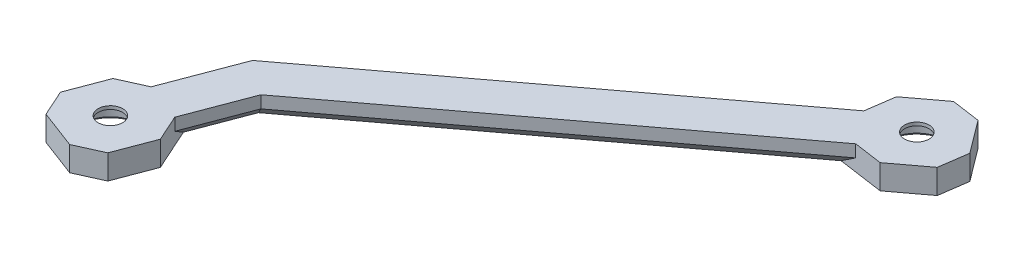
ISO-10303-21;
HEADER;
FILE_DESCRIPTION(('STEP AP214'),'2;1');
FILE_NAME('part.step','',(''),(''),'','','');
FILE_SCHEMA(('AUTOMOTIVE_DESIGN { 1 0 10303 214 1 1 1 1 }'));
ENDSEC;
DATA;
#1=APPLICATION_CONTEXT('core data for automotive mechanical design processes');
#2=APPLICATION_PROTOCOL_DEFINITION('international standard','automotive_design',2000,#1);
#3=PRODUCT_CONTEXT('',#1,'mechanical');
#4=PRODUCT('Part','Part','',(#3));
#5=PRODUCT_RELATED_PRODUCT_CATEGORY('part','',(#4));
#6=PRODUCT_DEFINITION_FORMATION('','',#4);
#7=PRODUCT_DEFINITION_CONTEXT('part definition',#1,'design');
#8=PRODUCT_DEFINITION('design','',#6,#7);
#9=PRODUCT_DEFINITION_SHAPE('','',#8);
#10=(LENGTH_UNIT() NAMED_UNIT(*) SI_UNIT(.MILLI.,.METRE.));
#11=(NAMED_UNIT(*) PLANE_ANGLE_UNIT() SI_UNIT($,.RADIAN.));
#12=(NAMED_UNIT(*) SI_UNIT($,.STERADIAN.) SOLID_ANGLE_UNIT());
#13=UNCERTAINTY_MEASURE_WITH_UNIT(LENGTH_MEASURE(1.E-05),#10,'distance_accuracy_value','');
#14=(GEOMETRIC_REPRESENTATION_CONTEXT(3) GLOBAL_UNCERTAINTY_ASSIGNED_CONTEXT((#13)) GLOBAL_UNIT_ASSIGNED_CONTEXT((#10,
#11,#12)) REPRESENTATION_CONTEXT('',''));
#15=CARTESIAN_POINT('',(0.,0.,0.));
#16=DIRECTION('',(0.,0.,1.));
#17=DIRECTION('',(1.,0.,0.));
#18=AXIS2_PLACEMENT_3D('',#15,#16,#17);
#19=CARTESIAN_POINT('',(129.479734703124,-542.305140304565,54.017746752288));
#20=DIRECTION('',(0.,-1.,0.));
#21=DIRECTION('',(0.,0.,-1.));
#22=AXIS2_PLACEMENT_3D('',#19,#20,#21);
#23=CYLINDRICAL_SURFACE('',#22,6.75);
#24=CARTESIAN_POINT('',(129.479734703124,-542.305140304565,54.017746752288));
#25=DIRECTION('',(0.,-1.,0.));
#26=DIRECTION('',(0.,0.,-1.));
#27=AXIS2_PLACEMENT_3D('',#24,#25,#26);
#28=CIRCLE('',#27,6.75);
#29=CARTESIAN_POINT('',(129.479734703124,-542.305140304565,47.267746752288));
#30=VERTEX_POINT('',#29);
#31=EDGE_CURVE('E228',#30,#30,#28,.T.);
#32=ORIENTED_EDGE('',*,*,#31,.F.);
#33=EDGE_LOOP('',(#32));
#34=FACE_BOUND('',#33,.T.);
#35=CARTESIAN_POINT('',(129.479734703124,-546.505140304565,54.017746752288));
#36=DIRECTION('',(0.,-1.,0.));
#37=DIRECTION('',(0.,0.,-1.));
#38=AXIS2_PLACEMENT_3D('',#35,#36,#37);
#39=CIRCLE('',#38,6.75);
#40=CARTESIAN_POINT('',(129.479734703124,-546.505140304565,47.267746752288));
#41=VERTEX_POINT('',#40);
#42=EDGE_CURVE('E404',#41,#41,#39,.F.);
#43=ORIENTED_EDGE('',*,*,#42,.F.);
#44=EDGE_LOOP('',(#43));
#45=FACE_BOUND('',#44,.T.);
#46=ADVANCED_FACE('F38',(#34,#45),#23,.F.);
#47=CARTESIAN_POINT('',(27.0683923401905,-542.305140304565,149.47530428751));
#48=DIRECTION('',(0.,-1.,0.));
#49=DIRECTION('',(0.,0.,-1.));
#50=AXIS2_PLACEMENT_3D('',#47,#48,#49);
#51=CYLINDRICAL_SURFACE('',#50,6.75);
#52=CARTESIAN_POINT('',(27.0683923401905,-542.305140304565,149.47530428751));
#53=DIRECTION('',(0.,-1.,0.));
#54=DIRECTION('',(0.,0.,-1.));
#55=AXIS2_PLACEMENT_3D('',#52,#53,#54);
#56=CIRCLE('',#55,6.75);
#57=CARTESIAN_POINT('',(27.0683923401905,-542.305140304565,142.72530428751));
#58=VERTEX_POINT('',#57);
#59=EDGE_CURVE('E223',#58,#58,#56,.T.);
#60=ORIENTED_EDGE('',*,*,#59,.F.);
#61=EDGE_LOOP('',(#60));
#62=FACE_BOUND('',#61,.T.);
#63=CARTESIAN_POINT('',(27.0683923401905,-546.505140304565,149.47530428751));
#64=DIRECTION('',(0.,-1.,0.));
#65=DIRECTION('',(0.,0.,-1.));
#66=AXIS2_PLACEMENT_3D('',#63,#64,#65);
#67=CIRCLE('',#66,6.75);
#68=CARTESIAN_POINT('',(27.0683923401905,-546.505140304565,142.72530428751));
#69=VERTEX_POINT('',#68);
#70=EDGE_CURVE('E401',#69,#69,#67,.F.);
#71=ORIENTED_EDGE('',*,*,#70,.F.);
#72=EDGE_LOOP('',(#71));
#73=FACE_BOUND('',#72,.T.);
#74=ADVANCED_FACE('F440',(#62,#73),#51,.F.);
#75=CARTESIAN_POINT('',(-49.6434018320776,0.,131.125269074854));
#76=DIRECTION('',(-0.354069498432484,0.,0.935219113512854));
#77=DIRECTION('',(0.935219113512854,0.,0.354069498432484));
#78=AXIS2_PLACEMENT_3D('',#75,#76,#77);
#79=PLANE('',#78);
#80=DIRECTION('',(0.,-1.,0.));
#81=VECTOR('',#80,1.);
#82=CARTESIAN_POINT('',(28.2037928700447,-541.505098342896,160.59784591198));
#83=LINE('',#82,#81);
#84=CARTESIAN_POINT('',(28.2037928700447,-541.505098342895,160.59784591198));
#85=VERTEX_POINT('',#84);
#86=CARTESIAN_POINT('',(28.2037928700447,-547.505140304565,160.59784591198));
#87=VERTEX_POINT('',#86);
#88=EDGE_CURVE('E96',#85,#87,#83,.T.);
#89=ORIENTED_EDGE('',*,*,#88,.F.);
#90=DIRECTION('',(0.935219113512854,0.,0.354069498432484));
#91=VECTOR('',#90,1.);
#92=CARTESIAN_POINT('',(28.2037928700447,-541.505098342895,160.59784591198));
#93=LINE('',#92,#91);
#94=CARTESIAN_POINT('',(18.8516024500132,-541.505098342895,157.057151198387));
#95=VERTEX_POINT('',#94);
#96=EDGE_CURVE('E256',#95,#85,#93,.T.);
#97=ORIENTED_EDGE('',*,*,#96,.F.);
#98=DIRECTION('',(0.,1.,0.));
#99=VECTOR('',#98,1.);
#100=CARTESIAN_POINT('',(18.8516024500132,-547.505140304565,157.057151198387));
#101=LINE('',#100,#99);
#102=CARTESIAN_POINT('',(18.8516024500132,-547.505140304565,157.057151198387));
#103=VERTEX_POINT('',#102);
#104=EDGE_CURVE('E392',#103,#95,#101,.T.);
#105=ORIENTED_EDGE('',*,*,#104,.F.);
#106=DIRECTION('',(0.935219113512854,0.,0.354069498432484));
#107=VECTOR('',#106,1.);
#108=CARTESIAN_POINT('',(18.8516024500132,-547.505140304565,157.057151198387));
#109=LINE('',#108,#107);
#110=EDGE_CURVE('E101',#103,#87,#109,.T.);
#111=ORIENTED_EDGE('',*,*,#110,.T.);
#112=EDGE_LOOP('',(#89,#97,#105,#111));
#113=FACE_BOUND('',#112,.T.);
#114=ADVANCED_FACE('F40',(#113),#79,.T.);
#115=CARTESIAN_POINT('',(-43.1708205184204,0.,19.4593086700157));
#116=DIRECTION('',(-0.911664969927574,0.,0.410934280155544));
#117=DIRECTION('',(0.410934280155544,0.,0.911664969927574));
#118=AXIS2_PLACEMENT_3D('',#115,#116,#117);
#119=PLANE('',#118);
#120=ORIENTED_EDGE('',*,*,#104,.T.);
#121=DIRECTION('',(0.410934280155544,0.,0.911664969927574));
#122=VECTOR('',#121,1.);
#123=CARTESIAN_POINT('',(18.8516024500132,-541.505098342895,157.057151198387));
#124=LINE('',#123,#122);
#125=CARTESIAN_POINT('',(15.9458555281162,-541.505098342895,150.610700249672));
#126=VERTEX_POINT('',#125);
#127=EDGE_CURVE('E253',#126,#95,#124,.T.);
#128=ORIENTED_EDGE('',*,*,#127,.F.);
#129=DIRECTION('',(0.,1.,0.));
#130=VECTOR('',#129,1.);
#131=CARTESIAN_POINT('',(15.9458555281162,-547.505140304565,150.610700249672));
#132=LINE('',#131,#130);
#133=CARTESIAN_POINT('',(15.9458555281162,-547.505140304565,150.610700249672));
#134=VERTEX_POINT('',#133);
#135=EDGE_CURVE('E216',#134,#126,#132,.T.);
#136=ORIENTED_EDGE('',*,*,#135,.F.);
#137=DIRECTION('',(0.410934280155544,0.,0.911664969927574));
#138=VECTOR('',#137,1.);
#139=CARTESIAN_POINT('',(15.9458555281162,-547.505140304565,150.610700249672));
#140=LINE('',#139,#138);
#141=EDGE_CURVE('E214',#134,#103,#140,.T.);
#142=ORIENTED_EDGE('',*,*,#141,.T.);
#143=EDGE_LOOP('',(#120,#128,#136,#142));
#144=FACE_BOUND('',#143,.T.);
#145=ADVANCED_FACE('F542',(#144),#119,.T.);
#146=CARTESIAN_POINT('',(64.9283734286021,0.,144.044116871902));
#147=DIRECTION('',(0.410935769571844,0.,0.911664298569598));
#148=DIRECTION('',(0.911664298569598,0.,-0.410935769571844));
#149=AXIS2_PLACEMENT_3D('',#146,#147,#148);
#150=PLANE('',#149);
#151=DIRECTION('',(0.,-1.,0.));
#152=VECTOR('',#151,1.);
#153=CARTESIAN_POINT('',(34.6502363681793,-541.505098342896,157.692089676857));
#154=LINE('',#153,#152);
#155=CARTESIAN_POINT('',(34.6502363681793,-541.505098342895,157.692089676857));
#156=VERTEX_POINT('',#155);
#157=CARTESIAN_POINT('',(34.6502363681793,-547.505140304565,157.692089676857));
#158=VERTEX_POINT('',#157);
#159=EDGE_CURVE('E373',#156,#158,#154,.T.);
#160=ORIENTED_EDGE('',*,*,#159,.F.);
#161=DIRECTION('',(0.911664298569598,0.,-0.410935769571844));
#162=VECTOR('',#161,1.);
#163=CARTESIAN_POINT('',(34.6502363681793,-541.505098342895,157.692089676857));
#164=LINE('',#163,#162);
#165=EDGE_CURVE('E259',#85,#156,#164,.T.);
#166=ORIENTED_EDGE('',*,*,#165,.F.);
#167=ORIENTED_EDGE('',*,*,#88,.T.);
#168=DIRECTION('',(0.911664298569598,0.,-0.410935769571843));
#169=VECTOR('',#168,1.);
#170=CARTESIAN_POINT('',(28.2037928700447,-547.505140304565,160.59784591198));
#171=LINE('',#170,#169);
#172=EDGE_CURVE('E389',#87,#158,#171,.T.);
#173=ORIENTED_EDGE('',*,*,#172,.T.);
#174=EDGE_LOOP('',(#160,#166,#167,#173));
#175=FACE_BOUND('',#174,.T.);
#176=ADVANCED_FACE('F539',(#175),#150,.T.);
#177=CARTESIAN_POINT('',(144.952876856489,0.,20.710121558638));
#178=DIRECTION('',(0.989947038457378,0.,0.141438541598343));
#179=DIRECTION('',(0.141438541598343,0.,-0.989947038457378));
#180=AXIS2_PLACEMENT_3D('',#177,#178,#179);
#181=PLANE('',#180);
#182=DIRECTION('',(0.,-1.,0.));
#183=VECTOR('',#182,1.);
#184=CARTESIAN_POINT('',(140.479773283005,-541.505098342896,52.0179644227028));
#185=LINE('',#184,#183);
#186=CARTESIAN_POINT('',(140.479773283005,-541.505098342895,52.0179644227028));
#187=VERTEX_POINT('',#186);
#188=CARTESIAN_POINT('',(140.479773283005,-547.505140304565,52.0179644227028));
#189=VERTEX_POINT('',#188);
#190=EDGE_CURVE('E363',#187,#189,#185,.T.);
#191=ORIENTED_EDGE('',*,*,#190,.F.);
#192=DIRECTION('',(0.141438541598343,0.,-0.989947038457378));
#193=VECTOR('',#192,1.);
#194=CARTESIAN_POINT('',(140.479773283005,-541.505098342895,52.0179644227028));
#195=LINE('',#194,#193);
#196=CARTESIAN_POINT('',(139.479652047157,-541.505098342895,59.0179450809956));
#197=VERTEX_POINT('',#196);
#198=EDGE_CURVE('E234',#197,#187,#195,.T.);
#199=ORIENTED_EDGE('',*,*,#198,.F.);
#200=DIRECTION('',(0.,1.,0.));
#201=VECTOR('',#200,1.);
#202=CARTESIAN_POINT('',(139.479652047157,-547.505140304565,59.0179450809956));
#203=LINE('',#202,#201);
#204=CARTESIAN_POINT('',(139.479652047157,-547.505140304565,59.0179450809956));
#205=VERTEX_POINT('',#204);
#206=EDGE_CURVE('E207',#205,#197,#203,.T.);
#207=ORIENTED_EDGE('',*,*,#206,.F.);
#208=DIRECTION('',(0.141438541598343,0.,-0.989947038457378));
#209=VECTOR('',#208,1.);
#210=CARTESIAN_POINT('',(139.479652047157,-547.505140304565,59.0179450809956));
#211=LINE('',#210,#209);
#212=EDGE_CURVE('E217',#205,#189,#211,.T.);
#213=ORIENTED_EDGE('',*,*,#212,.T.);
#214=EDGE_LOOP('',(#191,#199,#207,#213));
#215=FACE_BOUND('',#214,.T.);
#216=ADVANCED_FACE('F536',(#215),#181,.T.);
#217=CARTESIAN_POINT('',(63.8189360018059,0.,24.1615655712421));
#218=DIRECTION('',(-0.935219013507438,0.,-0.354069762581013));
#219=DIRECTION('',(-0.354069762581013,0.,0.935219013507438));
#220=AXIS2_PLACEMENT_3D('',#217,#218,#219);
#221=PLANE('',#220);
#222=ORIENTED_EDGE('',*,*,#135,.T.);
#223=DIRECTION('',(-0.354069762581013,0.,0.935219013507438));
#224=VECTOR('',#223,1.);
#225=CARTESIAN_POINT('',(15.9458555281162,-541.505098342895,150.610700249672));
#226=LINE('',#225,#224);
#227=CARTESIAN_POINT('',(19.4865539669991,-541.505098342895,141.258507966995));
#228=VERTEX_POINT('',#227);
#229=EDGE_CURVE('E200',#228,#126,#226,.T.);
#230=ORIENTED_EDGE('',*,*,#229,.F.);
#231=DIRECTION('',(0.,1.,0.));
#232=VECTOR('',#231,1.);
#233=CARTESIAN_POINT('',(19.4865539669991,-547.505140304565,141.258507966995));
#234=LINE('',#233,#232);
#235=CARTESIAN_POINT('',(19.4865539669991,-547.505140304565,141.258507966995));
#236=VERTEX_POINT('',#235);
#237=EDGE_CURVE('E195',#236,#228,#234,.T.);
#238=ORIENTED_EDGE('',*,*,#237,.F.);
#239=DIRECTION('',(-0.354069762581013,0.,0.935219013507438));
#240=VECTOR('',#239,1.);
#241=CARTESIAN_POINT('',(19.4865539669991,-547.505140304565,141.258507966995));
#242=LINE('',#241,#240);
#243=EDGE_CURVE('E198',#236,#134,#242,.T.);
#244=ORIENTED_EDGE('',*,*,#243,.T.);
#245=EDGE_LOOP('',(#222,#230,#238,#244));
#246=FACE_BOUND('',#245,.T.);
#247=ADVANCED_FACE('F197',(#246),#221,.T.);
#248=CARTESIAN_POINT('',(82.52331484176,0.,31.242960281397));
#249=DIRECTION('',(0.935219013507438,0.,0.354069762581013));
#250=DIRECTION('',(0.354069762581013,0.,-0.935219013507438));
#251=AXIS2_PLACEMENT_3D('',#248,#249,#250);
#252=PLANE('',#251);
#253=DIRECTION('',(0.,1.,0.));
#254=VECTOR('',#253,1.);
#255=CARTESIAN_POINT('',(38.1909348070621,-547.505140304565,148.33989739418));
#256=LINE('',#255,#254);
#257=CARTESIAN_POINT('',(38.1909348070621,-547.505140304565,148.33989739418));
#258=VERTEX_POINT('',#257);
#259=CARTESIAN_POINT('',(38.1909348070621,-541.505098342895,148.33989739418));
#260=VERTEX_POINT('',#259);
#261=EDGE_CURVE('E368',#258,#260,#256,.T.);
#262=ORIENTED_EDGE('',*,*,#261,.T.);
#263=DIRECTION('',(0.354069762581013,0.,-0.935219013507438));
#264=VECTOR('',#263,1.);
#265=CARTESIAN_POINT('',(38.1909348070621,-541.505098342895,148.33989739418));
#266=LINE('',#265,#264);
#267=EDGE_CURVE('E262',#156,#260,#266,.T.);
#268=ORIENTED_EDGE('',*,*,#267,.F.);
#269=ORIENTED_EDGE('',*,*,#159,.T.);
#270=DIRECTION('',(0.354069762581013,0.,-0.935219013507438));
#271=VECTOR('',#270,1.);
#272=CARTESIAN_POINT('',(34.6502363681793,-547.505140304565,157.692089676857));
#273=LINE('',#272,#271);
#274=EDGE_CURVE('E374',#158,#258,#273,.T.);
#275=ORIENTED_EDGE('',*,*,#274,.T.);
#276=EDGE_LOOP('',(#262,#268,#269,#275));
#277=FACE_BOUND('',#276,.T.);
#278=ADVANCED_FACE('F529',(#277),#252,.T.);
#279=CARTESIAN_POINT('',(64.9414713142655,0.,-48.7040395860676));
#280=DIRECTION('',(0.800012203893529,0.,-0.599983727797195));
#281=DIRECTION('',(-0.599983727797195,0.,-0.800012203893529));
#282=AXIS2_PLACEMENT_3D('',#279,#280,#281);
#283=PLANE('',#282);
#284=DIRECTION('',(0.,-1.,0.));
#285=VECTOR('',#284,1.);
#286=CARTESIAN_POINT('',(134.479939937592,-541.505098342896,44.0178476274014));
#287=LINE('',#286,#285);
#288=CARTESIAN_POINT('',(134.479939937592,-541.505098342895,44.0178476274014));
#289=VERTEX_POINT('',#288);
#290=CARTESIAN_POINT('',(134.479939937592,-547.505140304565,44.0178476274014));
#291=VERTEX_POINT('',#290);
#292=EDGE_CURVE('E313',#289,#291,#287,.T.);
#293=ORIENTED_EDGE('',*,*,#292,.F.);
#294=DIRECTION('',(-0.599983727797195,0.,-0.800012203893529));
#295=VECTOR('',#294,1.);
#296=CARTESIAN_POINT('',(134.479939937592,-541.505098342895,44.0178476274014));
#297=LINE('',#296,#295);
#298=EDGE_CURVE('E237',#187,#289,#297,.T.);
#299=ORIENTED_EDGE('',*,*,#298,.F.);
#300=ORIENTED_EDGE('',*,*,#190,.T.);
#301=DIRECTION('',(-0.599983727797195,0.,-0.800012203893529));
#302=VECTOR('',#301,1.);
#303=CARTESIAN_POINT('',(140.479773283005,-547.505140304565,52.0179644227028));
#304=LINE('',#303,#302);
#305=EDGE_CURVE('E364',#189,#291,#304,.T.);
#306=ORIENTED_EDGE('',*,*,#305,.T.);
#307=EDGE_LOOP('',(#293,#299,#300,#306));
#308=FACE_BOUND('',#307,.T.);
#309=ADVANCED_FACE('F525',(#308),#283,.T.);
#310=CARTESIAN_POINT('',(78.5381950830812,0.,104.722079749864));
#311=DIRECTION('',(0.599983549015946,0.,0.800012337973753));
#312=DIRECTION('',(0.800012337973753,0.,-0.599983549015946));
#313=AXIS2_PLACEMENT_3D('',#310,#311,#312);
#314=PLANE('',#313);
#315=ORIENTED_EDGE('',*,*,#206,.T.);
#316=DIRECTION('',(0.800012337973753,0.,-0.599983549015946));
#317=VECTOR('',#316,1.);
#318=CARTESIAN_POINT('',(139.479652047157,-541.505098342895,59.0179450809956));
#319=LINE('',#318,#317);
#320=CARTESIAN_POINT('',(131.479516625404,-541.505098342895,65.0177896022797));
#321=VERTEX_POINT('',#320);
#322=EDGE_CURVE('E225',#321,#197,#319,.T.);
#323=ORIENTED_EDGE('',*,*,#322,.F.);
#324=DIRECTION('',(0.,-1.,0.));
#325=VECTOR('',#324,1.);
#326=CARTESIAN_POINT('',(131.479516625404,-541.505098342896,65.0177896022797));
#327=LINE('',#326,#325);
#328=CARTESIAN_POINT('',(131.479516625404,-547.505140304565,65.0177896022797));
#329=VERTEX_POINT('',#328);
#330=EDGE_CURVE('E352',#321,#329,#327,.T.);
#331=ORIENTED_EDGE('',*,*,#330,.T.);
#332=DIRECTION('',(0.800012337973753,0.,-0.599983549015946));
#333=VECTOR('',#332,1.);
#334=CARTESIAN_POINT('',(131.479516625404,-547.505140304565,65.0177896022797));
#335=LINE('',#334,#333);
#336=EDGE_CURVE('E353',#329,#205,#335,.T.);
#337=ORIENTED_EDGE('',*,*,#336,.T.);
#338=EDGE_LOOP('',(#315,#323,#331,#337));
#339=FACE_BOUND('',#338,.T.);
#340=ADVANCED_FACE('F521',(#339),#314,.T.);
#341=CARTESIAN_POINT('',(-6.47342282222166,0.,45.3073530902757));
#342=DIRECTION('',(0.141441565607845,0.,-0.98994660639774));
#343=DIRECTION('',(-0.98994660639774,0.,-0.141441565607845));
#344=AXIS2_PLACEMENT_3D('',#341,#342,#343);
#345=PLANE('',#344);
#346=ORIENTED_EDGE('',*,*,#330,.F.);
#347=DIRECTION('',(0.98994660639774,0.,0.141441565607845));
#348=VECTOR('',#347,1.);
#349=CARTESIAN_POINT('',(131.479516625404,-541.505098342895,65.0177896022797));
#350=LINE('',#349,#348);
#351=CARTESIAN_POINT('',(124.479532241821,-541.505098342895,64.0176460146904));
#352=VERTEX_POINT('',#351);
#353=EDGE_CURVE('E271',#352,#321,#350,.T.);
#354=ORIENTED_EDGE('',*,*,#353,.F.);
#355=DIRECTION('',(0.,-1.,0.));
#356=VECTOR('',#355,1.);
#357=CARTESIAN_POINT('',(124.479532241821,-541.505098342895,64.0176460146904));
#358=LINE('',#357,#356);
#359=CARTESIAN_POINT('',(124.479533558646,-544.505121518486,64.0176477705298));
#360=VERTEX_POINT('',#359);
#361=EDGE_CURVE('E274',#352,#360,#358,.T.);
#362=ORIENTED_EDGE('',*,*,#361,.T.);
#363=DIRECTION('',(0.808286247231902,0.577352850059177,0.115486055713726));
#364=VECTOR('',#363,1.);
#365=CARTESIAN_POINT('',(120.279543101788,-547.505140304565,63.417561352253));
#366=LINE('',#365,#364);
#367=CARTESIAN_POINT('',(120.279543101788,-547.505140304565,63.417561352253));
#368=VERTEX_POINT('',#367);
#369=EDGE_CURVE('E309',#368,#360,#366,.T.);
#370=ORIENTED_EDGE('',*,*,#369,.F.);
#371=DIRECTION('',(0.989946622204622,0.,0.14144145497576));
#372=VECTOR('',#371,1.);
#373=CARTESIAN_POINT('',(120.279543101788,-547.505140304565,63.417561352253));
#374=LINE('',#373,#372);
#375=EDGE_CURVE('E357',#368,#329,#374,.T.);
#376=ORIENTED_EDGE('',*,*,#375,.T.);
#377=EDGE_LOOP('',(#346,#354,#362,#370,#376));
#378=FACE_BOUND('',#377,.T.);
#379=ADVANCED_FACE('F514',(#378),#345,.F.);
#380=CARTESIAN_POINT('',(-23.8316201354801,0.,10.7421683441062));
#381=DIRECTION('',(0.9116645153807,0.,-0.410935288574337));
#382=DIRECTION('',(-0.410935288574337,0.,-0.9116645153807));
#383=AXIS2_PLACEMENT_3D('',#380,#381,#382);
#384=PLANE('',#383);
#385=DIRECTION('',(-0.335526570667552,-0.577354362423804,-0.74436809480678));
#386=VECTOR('',#385,1.);
#387=CARTESIAN_POINT('',(35.2851860225201,-544.50511932373,141.893461346626));
#388=LINE('',#387,#386);
#389=CARTESIAN_POINT('',(35.2851912753888,-544.505124940422,141.893463335336));
#390=VERTEX_POINT('',#389);
#391=CARTESIAN_POINT('',(33.5417389869689,-547.505140304566,138.025611639023));
#392=VERTEX_POINT('',#391);
#393=EDGE_CURVE('E335',#390,#392,#388,.T.);
#394=ORIENTED_EDGE('',*,*,#393,.F.);
#395=DIRECTION('',(0.,-1.,0.));
#396=VECTOR('',#395,1.);
#397=CARTESIAN_POINT('',(35.2851860225201,-541.505098342895,141.893461346626));
#398=LINE('',#397,#396);
#399=CARTESIAN_POINT('',(35.2851860225201,-541.505098342895,141.893461346626));
#400=VERTEX_POINT('',#399);
#401=EDGE_CURVE('E279',#400,#390,#398,.T.);
#402=ORIENTED_EDGE('',*,*,#401,.F.);
#403=DIRECTION('',(-0.410935288574337,0.,-0.9116645153807));
#404=VECTOR('',#403,1.);
#405=CARTESIAN_POINT('',(35.2851860225201,-541.505098342895,141.893461346626));
#406=LINE('',#405,#404);
#407=EDGE_CURVE('E265',#260,#400,#406,.T.);
#408=ORIENTED_EDGE('',*,*,#407,.F.);
#409=ORIENTED_EDGE('',*,*,#261,.F.);
#410=DIRECTION('',(-0.410935519115743,0.,-0.911664411463492));
#411=VECTOR('',#410,1.);
#412=CARTESIAN_POINT('',(38.1909348070621,-547.505140304565,148.33989739418));
#413=LINE('',#412,#411);
#414=EDGE_CURVE('E378',#258,#392,#413,.T.);
#415=ORIENTED_EDGE('',*,*,#414,.T.);
#416=EDGE_LOOP('',(#394,#402,#408,#409,#415));
#417=FACE_BOUND('',#416,.T.);
#418=ADVANCED_FACE('F506',(#417),#384,.T.);
#419=CARTESIAN_POINT('',(-220.367994295224,-235.630644776805,-83.4303256463113));
#420=DIRECTION('',(-0.661302318628494,-0.707104006773664,-0.250366065953852));
#421=DIRECTION('',(0.730365230114586,-0.683056828265166,0.));
#422=AXIS2_PLACEMENT_3D('',#419,#420,#421);
#423=PLANE('',#422);
#424=DIRECTION('',(-0.354069696803158,0.,0.935219038410639));
#425=VECTOR('',#424,1.);
#426=CARTESIAN_POINT('',(35.2654047310352,-547.505140304565,122.175596654415));
#427=LINE('',#426,#425);
#428=CARTESIAN_POINT('',(35.2654047310352,-547.505140304565,122.175596654415));
#429=VERTEX_POINT('',#428);
#430=CARTESIAN_POINT('',(29.8008661066296,-547.505140304565,136.60932068657));
#431=VERTEX_POINT('',#430);
#432=EDGE_CURVE('E318',#429,#431,#427,.T.);
#433=ORIENTED_EDGE('',*,*,#432,.T.);
#434=DIRECTION('',(-0.744369354357326,0.577352837040572,0.33552640112942));
#435=VECTOR('',#434,1.);
#436=CARTESIAN_POINT('',(29.8008639365435,-547.505140304565,136.609315872192));
#437=LINE('',#436,#435);
#438=CARTESIAN_POINT('',(25.9329974651337,-544.50511932373,138.352766633034));
#439=VERTEX_POINT('',#438);
#440=EDGE_CURVE('E221',#431,#439,#437,.T.);
#441=ORIENTED_EDGE('',*,*,#440,.T.);
#442=DIRECTION('',(0.354069785973779,0.,-0.93521900465104));
#443=VECTOR('',#442,1.);
#444=CARTESIAN_POINT('',(25.9329974651337,-544.50511932373,138.352766633034));
#445=LINE('',#444,#443);
#446=CARTESIAN_POINT('',(32.7682979404926,-544.50511932373,120.298407971859));
#447=VERTEX_POINT('',#446);
#448=EDGE_CURVE('E327',#439,#447,#445,.T.);
#449=ORIENTED_EDGE('',*,*,#448,.T.);
#450=DIRECTION('',(0.57653598835794,-0.692649616680754,0.433408309380586));
#451=VECTOR('',#450,1.);
#452=CARTESIAN_POINT('',(32.7682979404926,-544.50511932373,120.298407971859));
#453=LINE('',#452,#451);
#454=EDGE_CURVE('E108',#447,#429,#453,.T.);
#455=ORIENTED_EDGE('',*,*,#454,.T.);
#456=EDGE_LOOP('',(#433,#441,#449,#455));
#457=FACE_BOUND('',#456,.T.);
#458=ADVANCED_FACE('F503',(#457),#423,.T.);
#459=CARTESIAN_POINT('',(-3.47299137580907,0.,24.3074856941509));
#460=DIRECTION('',(0.141441049312258,0.,-0.98994668016487));
#461=DIRECTION('',(-0.98994668016487,0.,-0.141441049312258));
#462=AXIS2_PLACEMENT_3D('',#459,#460,#461);
#463=PLANE('',#462);
#464=DIRECTION('',(0.,-1.,0.));
#465=VECTOR('',#464,1.);
#466=CARTESIAN_POINT('',(127.479955554008,-541.505098342896,43.0177077651024));
#467=LINE('',#466,#465);
#468=CARTESIAN_POINT('',(127.479955554008,-541.505098342895,43.0177077651024));
#469=VERTEX_POINT('',#468);
#470=CARTESIAN_POINT('',(127.479955554008,-547.505140304565,43.0177077651024));
#471=VERTEX_POINT('',#470);
#472=EDGE_CURVE('E292',#469,#471,#467,.T.);
#473=ORIENTED_EDGE('',*,*,#472,.F.);
#474=DIRECTION('',(-0.98994668016487,0.,-0.141441049312258));
#475=VECTOR('',#474,1.);
#476=CARTESIAN_POINT('',(127.479955554008,-541.505098342895,43.0177077651024));
#477=LINE('',#476,#475);
#478=EDGE_CURVE('E240',#289,#469,#477,.T.);
#479=ORIENTED_EDGE('',*,*,#478,.F.);
#480=ORIENTED_EDGE('',*,*,#292,.T.);
#481=DIRECTION('',(-0.98994668016487,0.,-0.141441049312258));
#482=VECTOR('',#481,1.);
#483=CARTESIAN_POINT('',(134.479939937592,-547.505140304565,44.0178476274014));
#484=LINE('',#483,#482);
#485=EDGE_CURVE('E314',#291,#471,#484,.T.);
#486=ORIENTED_EDGE('',*,*,#485,.T.);
#487=EDGE_LOOP('',(#473,#479,#480,#486));
#488=FACE_BOUND('',#487,.T.);
#489=ADVANCED_FACE('F505',(#488),#463,.T.);
#490=CARTESIAN_POINT('',(-128.577661431331,-214.300097273428,-171.443993125453));
#491=DIRECTION('',(0.424254482814095,0.707103986210737,0.565696107903378));
#492=DIRECTION('',(0.,-0.624703746604736,0.780861850123315));
#493=AXIS2_PLACEMENT_3D('',#490,#491,#492);
#494=PLANE('',#493);
#495=DIRECTION('',(0.115486122636213,0.577353184626739,-0.808285998690944));
#496=VECTOR('',#495,1.);
#497=CARTESIAN_POINT('',(117.87960678339,-547.505140304565,60.2175146341324));
#498=LINE('',#497,#496);
#499=CARTESIAN_POINT('',(117.87960678339,-547.505140304565,60.2175146341324));
#500=VERTEX_POINT('',#499);
#501=CARTESIAN_POINT('',(118.479691445827,-544.50511932373,56.017529219389));
#502=VERTEX_POINT('',#501);
#503=EDGE_CURVE('E300',#500,#502,#498,.T.);
#504=ORIENTED_EDGE('',*,*,#503,.F.);
#505=DIRECTION('',(-0.80001194342984,0.,0.599984075096674));
#506=VECTOR('',#505,1.);
#507=CARTESIAN_POINT('',(117.87960678339,-547.505140304565,60.2175146341324));
#508=LINE('',#507,#506);
#509=EDGE_CURVE('E58',#500,#429,#508,.T.);
#510=ORIENTED_EDGE('',*,*,#509,.T.);
#511=ORIENTED_EDGE('',*,*,#454,.F.);
#512=DIRECTION('',(-0.800011945789754,0.,0.599984071949991));
#513=VECTOR('',#512,1.);
#514=CARTESIAN_POINT('',(118.479691445827,-544.50511932373,56.017529219389));
#515=LINE('',#514,#513);
#516=EDGE_CURVE('E11',#502,#447,#515,.T.);
#517=ORIENTED_EDGE('',*,*,#516,.F.);
#518=EDGE_LOOP('',(#504,#510,#511,#517));
#519=FACE_BOUND('',#518,.T.);
#520=ADVANCED_FACE('F502',(#519),#494,.F.);
#521=CARTESIAN_POINT('',(66.5385995716973,0.,88.7218234524504));
#522=DIRECTION('',(-0.599984025837021,0.,-0.800011980373045));
#523=DIRECTION('',(-0.800011980373045,0.,0.599984025837021));
#524=AXIS2_PLACEMENT_3D('',#521,#522,#523);
#525=PLANE('',#524);
#526=DIRECTION('',(0.,1.,0.));
#527=VECTOR('',#526,1.);
#528=CARTESIAN_POINT('',(119.479835033417,-547.505140304565,49.0175485610962));
#529=LINE('',#528,#527);
#530=CARTESIAN_POINT('',(119.479835033417,-547.505140304565,49.0175485610962));
#531=VERTEX_POINT('',#530);
#532=CARTESIAN_POINT('',(119.479835033417,-541.505098342895,49.0175485610962));
#533=VERTEX_POINT('',#532);
#534=EDGE_CURVE('E49',#531,#533,#529,.T.);
#535=ORIENTED_EDGE('',*,*,#534,.T.);
#536=DIRECTION('',(-0.800011980373045,0.,0.599984025837021));
#537=VECTOR('',#536,1.);
#538=CARTESIAN_POINT('',(119.479835033417,-541.505098342895,49.0175485610962));
#539=LINE('',#538,#537);
#540=EDGE_CURVE('E243',#469,#533,#539,.T.);
#541=ORIENTED_EDGE('',*,*,#540,.F.);
#542=ORIENTED_EDGE('',*,*,#472,.T.);
#543=DIRECTION('',(-0.800011980373045,0.,0.599984025837021));
#544=VECTOR('',#543,1.);
#545=CARTESIAN_POINT('',(127.479955554008,-547.505140304565,43.0177077651024));
#546=LINE('',#545,#544);
#547=EDGE_CURVE('E293',#471,#531,#546,.T.);
#548=ORIENTED_EDGE('',*,*,#547,.T.);
#549=EDGE_LOOP('',(#535,#541,#542,#548));
#550=FACE_BOUND('',#549,.T.);
#551=ADVANCED_FACE('F448',(#550),#525,.T.);
#552=CARTESIAN_POINT('',(123.952973780132,0.,17.7101592047906));
#553=DIRECTION('',(-0.989946595858015,0.,-0.141441639375142));
#554=DIRECTION('',(-0.141441639375142,0.,0.989946595858015));
#555=AXIS2_PLACEMENT_3D('',#552,#553,#554);
#556=PLANE('',#555);
#557=ORIENTED_EDGE('',*,*,#503,.T.);
#558=DIRECTION('',(0.,-1.,0.));
#559=VECTOR('',#558,1.);
#560=CARTESIAN_POINT('',(118.479691445827,-541.505098342895,56.017529219389));
#561=LINE('',#560,#559);
#562=CARTESIAN_POINT('',(118.479691445827,-541.505098342895,56.017529219389));
#563=VERTEX_POINT('',#562);
#564=EDGE_CURVE('E287',#563,#502,#561,.T.);
#565=ORIENTED_EDGE('',*,*,#564,.F.);
#566=DIRECTION('',(-0.141441639375142,0.,0.989946595858015));
#567=VECTOR('',#566,1.);
#568=CARTESIAN_POINT('',(118.479691445827,-541.505098342895,56.017529219389));
#569=LINE('',#568,#567);
#570=EDGE_CURVE('E246',#533,#563,#569,.T.);
#571=ORIENTED_EDGE('',*,*,#570,.F.);
#572=ORIENTED_EDGE('',*,*,#534,.F.);
#573=DIRECTION('',(-0.141441547184836,0.,0.989946609029982));
#574=VECTOR('',#573,1.);
#575=CARTESIAN_POINT('',(119.479835033417,-547.505140304565,49.0175485610962));
#576=LINE('',#575,#574);
#577=EDGE_CURVE('E297',#531,#500,#576,.T.);
#578=ORIENTED_EDGE('',*,*,#577,.T.);
#579=EDGE_LOOP('',(#557,#565,#571,#572,#578));
#580=FACE_BOUND('',#579,.T.);
#581=ADVANCED_FACE('F437',(#580),#556,.T.);
#582=CARTESIAN_POINT('',(0.,-547.505140304565,0.));
#583=DIRECTION('',(0.,-1.,0.));
#584=DIRECTION('',(0.,0.,-1.));
#585=AXIS2_PLACEMENT_3D('',#582,#583,#584);
#586=PLANE('',#585);
#587=CARTESIAN_POINT('',(27.0683923401905,-547.505140304565,149.47530428751));
#588=DIRECTION('',(0.,-1.,0.));
#589=DIRECTION('',(0.,0.,-1.));
#590=AXIS2_PLACEMENT_3D('',#587,#588,#589);
#591=CIRCLE('',#590,7.84999999999999);
#592=CARTESIAN_POINT('',(27.0683923401905,-547.505140304565,141.62530428751));
#593=VERTEX_POINT('',#592);
#594=EDGE_CURVE('E424',#593,#593,#591,.T.);
#595=ORIENTED_EDGE('',*,*,#594,.F.);
#596=EDGE_LOOP('',(#595));
#597=FACE_BOUND('',#596,.T.);
#598=CARTESIAN_POINT('',(129.479734703124,-547.505140304565,54.017746752288));
#599=DIRECTION('',(0.,-1.,0.));
#600=DIRECTION('',(0.,0.,-1.));
#601=AXIS2_PLACEMENT_3D('',#598,#599,#600);
#602=CIRCLE('',#601,7.84999999999999);
#603=CARTESIAN_POINT('',(129.479734703124,-547.505140304565,46.167746752288));
#604=VERTEX_POINT('',#603);
#605=EDGE_CURVE('E413',#604,#604,#602,.T.);
#606=ORIENTED_EDGE('',*,*,#605,.F.);
#607=EDGE_LOOP('',(#606));
#608=FACE_BOUND('',#607,.T.);
#609=DIRECTION('',(-0.911665088053401,0.,0.410934018091208));
#610=VECTOR('',#609,1.);
#611=CARTESIAN_POINT('',(29.8008661066296,-547.505140304565,136.60932068657));
#612=LINE('',#611,#610);
#613=EDGE_CURVE('E211',#431,#236,#612,.T.);
#614=ORIENTED_EDGE('',*,*,#613,.F.);
#615=ORIENTED_EDGE('',*,*,#432,.F.);
#616=ORIENTED_EDGE('',*,*,#509,.F.);
#617=ORIENTED_EDGE('',*,*,#577,.F.);
#618=ORIENTED_EDGE('',*,*,#547,.F.);
#619=ORIENTED_EDGE('',*,*,#485,.F.);
#620=ORIENTED_EDGE('',*,*,#305,.F.);
#621=ORIENTED_EDGE('',*,*,#212,.F.);
#622=ORIENTED_EDGE('',*,*,#336,.F.);
#623=ORIENTED_EDGE('',*,*,#375,.F.);
#624=DIRECTION('',(0.800011947996977,0.,-0.599984069006904));
#625=VECTOR('',#624,1.);
#626=CARTESIAN_POINT('',(38.5948829352856,-547.505140304565,124.678514897823));
#627=LINE('',#626,#625);
#628=CARTESIAN_POINT('',(38.5948829352857,-547.505140304566,124.678514897823));
#629=VERTEX_POINT('',#628);
#630=EDGE_CURVE('E206',#629,#368,#627,.T.);
#631=ORIENTED_EDGE('',*,*,#630,.F.);
#632=DIRECTION('',(0.354069298900997,0.,-0.9352191890545));
#633=VECTOR('',#632,1.);
#634=CARTESIAN_POINT('',(33.541738986969,-547.505140304565,138.025611639023));
#635=LINE('',#634,#633);
#636=EDGE_CURVE('E339',#392,#629,#635,.T.);
#637=ORIENTED_EDGE('',*,*,#636,.F.);
#638=ORIENTED_EDGE('',*,*,#414,.F.);
#639=ORIENTED_EDGE('',*,*,#274,.F.);
#640=ORIENTED_EDGE('',*,*,#172,.F.);
#641=ORIENTED_EDGE('',*,*,#110,.F.);
#642=ORIENTED_EDGE('',*,*,#141,.F.);
#643=ORIENTED_EDGE('',*,*,#243,.F.);
#644=EDGE_LOOP('',(#614,#615,#616,#617,#618,#619,#620,#621,#622,#623,#631,#637,#638,#639,#640,
#641,#642,#643));
#645=FACE_BOUND('',#644,.T.);
#646=ADVANCED_FACE('F210',(#597,#608,#645),#586,.T.);
#647=CARTESIAN_POINT('',(32.7682979404926,-541.505098342895,120.298407971859));
#648=DIRECTION('',(0.599984071949991,0.,0.800011945789754));
#649=DIRECTION('',(0.800011945789754,0.,-0.599984071949991));
#650=AXIS2_PLACEMENT_3D('',#647,#648,#649);
#651=PLANE('',#650);
#652=ORIENTED_EDGE('',*,*,#516,.T.);
#653=DIRECTION('',(0.,-1.,0.));
#654=VECTOR('',#653,1.);
#655=CARTESIAN_POINT('',(32.7682979404926,-541.505098342895,120.298407971859));
#656=LINE('',#655,#654);
#657=CARTESIAN_POINT('',(32.7682979404926,-541.505098342895,120.298407971859));
#658=VERTEX_POINT('',#657);
#659=EDGE_CURVE('E284',#658,#447,#656,.T.);
#660=ORIENTED_EDGE('',*,*,#659,.F.);
#661=DIRECTION('',(-0.800011945789754,0.,0.599984071949991));
#662=VECTOR('',#661,1.);
#663=CARTESIAN_POINT('',(32.7682979404926,-541.505098342895,120.298407971859));
#664=LINE('',#663,#662);
#665=EDGE_CURVE('E248',#563,#658,#664,.T.);
#666=ORIENTED_EDGE('',*,*,#665,.F.);
#667=ORIENTED_EDGE('',*,*,#564,.T.);
#668=EDGE_LOOP('',(#652,#660,#666,#667));
#669=FACE_BOUND('',#668,.T.);
#670=ADVANCED_FACE('F436',(#669),#651,.F.);
#671=CARTESIAN_POINT('',(25.9329974651337,-541.505098342895,138.352766633034));
#672=DIRECTION('',(0.93521900465104,0.,0.354069785973779));
#673=DIRECTION('',(0.354069785973779,0.,-0.93521900465104));
#674=AXIS2_PLACEMENT_3D('',#671,#672,#673);
#675=PLANE('',#674);
#676=ORIENTED_EDGE('',*,*,#448,.F.);
#677=DIRECTION('',(0.,-1.,0.));
#678=VECTOR('',#677,1.);
#679=CARTESIAN_POINT('',(25.9329974651337,-541.505098342895,138.352766633034));
#680=LINE('',#679,#678);
#681=CARTESIAN_POINT('',(25.9329974651337,-541.505098342895,138.352766633034));
#682=VERTEX_POINT('',#681);
#683=EDGE_CURVE('E282',#682,#439,#680,.T.);
#684=ORIENTED_EDGE('',*,*,#683,.F.);
#685=DIRECTION('',(-0.354069785973779,0.,0.93521900465104));
#686=VECTOR('',#685,1.);
#687=CARTESIAN_POINT('',(25.9329974651337,-541.505098342895,138.352766633034));
#688=LINE('',#687,#686);
#689=EDGE_CURVE('E250',#658,#682,#688,.T.);
#690=ORIENTED_EDGE('',*,*,#689,.F.);
#691=ORIENTED_EDGE('',*,*,#659,.T.);
#692=EDGE_LOOP('',(#676,#684,#690,#691));
#693=FACE_BOUND('',#692,.T.);
#694=ADVANCED_FACE('F445',(#693),#675,.F.);
#695=CARTESIAN_POINT('',(41.0919934511185,-541.505098342895,126.55571103096));
#696=DIRECTION('',(-0.935218946532656,0.,-0.354069939484206));
#697=DIRECTION('',(-0.354069939484206,0.,0.935218946532656));
#698=AXIS2_PLACEMENT_3D('',#695,#696,#697);
#699=PLANE('',#698);
#700=DIRECTION('',(0.354069939484206,0.,-0.935218946532656));
#701=VECTOR('',#700,1.);
#702=CARTESIAN_POINT('',(35.2851860225201,-544.50511932373,141.893461346626));
#703=LINE('',#702,#701);
#704=CARTESIAN_POINT('',(41.0919934511184,-544.505119323731,126.55571103096));
#705=VERTEX_POINT('',#704);
#706=EDGE_CURVE('E330',#390,#705,#703,.T.);
#707=ORIENTED_EDGE('',*,*,#706,.T.);
#708=DIRECTION('',(0.,-1.,0.));
#709=VECTOR('',#708,1.);
#710=CARTESIAN_POINT('',(41.0919934511185,-541.505098342895,126.55571103096));
#711=LINE('',#710,#709);
#712=CARTESIAN_POINT('',(41.0919934511185,-541.505098342895,126.55571103096));
#713=VERTEX_POINT('',#712);
#714=EDGE_CURVE('E276',#713,#705,#711,.T.);
#715=ORIENTED_EDGE('',*,*,#714,.F.);
#716=DIRECTION('',(0.354069939484206,0.,-0.935218946532656));
#717=VECTOR('',#716,1.);
#718=CARTESIAN_POINT('',(41.0919934511185,-541.505098342895,126.55571103096));
#719=LINE('',#718,#717);
#720=EDGE_CURVE('E267',#400,#713,#719,.T.);
#721=ORIENTED_EDGE('',*,*,#720,.F.);
#722=ORIENTED_EDGE('',*,*,#401,.T.);
#723=EDGE_LOOP('',(#707,#715,#721,#722));
#724=FACE_BOUND('',#723,.T.);
#725=ADVANCED_FACE('F482',(#724),#699,.F.);
#726=CARTESIAN_POINT('',(124.479532241821,-541.505098342895,64.0176460146904));
#727=DIRECTION('',(-0.599984102697436,0.,-0.800011922730125));
#728=DIRECTION('',(-0.800011922730125,0.,0.599984102697436));
#729=AXIS2_PLACEMENT_3D('',#726,#727,#728);
#730=PLANE('',#729);
#731=DIRECTION('',(0.800011922730125,0.,-0.599984102697436));
#732=VECTOR('',#731,1.);
#733=CARTESIAN_POINT('',(41.0919934511185,-544.50511932373,126.55571103096));
#734=LINE('',#733,#732);
#735=EDGE_CURVE('E303',#705,#360,#734,.T.);
#736=ORIENTED_EDGE('',*,*,#735,.T.);
#737=ORIENTED_EDGE('',*,*,#361,.F.);
#738=DIRECTION('',(0.800011922730125,0.,-0.599984102697436));
#739=VECTOR('',#738,1.);
#740=CARTESIAN_POINT('',(124.479532241821,-541.505098342895,64.0176460146904));
#741=LINE('',#740,#739);
#742=EDGE_CURVE('E269',#713,#352,#741,.T.);
#743=ORIENTED_EDGE('',*,*,#742,.F.);
#744=ORIENTED_EDGE('',*,*,#714,.T.);
#745=EDGE_LOOP('',(#736,#737,#743,#744));
#746=FACE_BOUND('',#745,.T.);
#747=ADVANCED_FACE('F478',(#746),#730,.F.);
#748=CARTESIAN_POINT('',(0.,-541.505098342895,0.));
#749=DIRECTION('',(0.,1.,0.));
#750=DIRECTION('',(0.,0.,1.));
#751=AXIS2_PLACEMENT_3D('',#748,#749,#750);
#752=PLANE('',#751);
#753=CARTESIAN_POINT('',(27.0683923401905,-541.505098342895,149.47530428751));
#754=DIRECTION('',(0.,1.,0.));
#755=DIRECTION('',(0.,0.,1.));
#756=AXIS2_PLACEMENT_3D('',#753,#754,#755);
#757=CIRCLE('',#756,3.);
#758=CARTESIAN_POINT('',(27.0683923401905,-541.505098342895,152.47530428751));
#759=VERTEX_POINT('',#758);
#760=EDGE_CURVE('E409',#759,#759,#757,.T.);
#761=ORIENTED_EDGE('',*,*,#760,.F.);
#762=EDGE_LOOP('',(#761));
#763=FACE_BOUND('',#762,.T.);
#764=CARTESIAN_POINT('',(129.479734703124,-541.505098342895,54.017746752288));
#765=DIRECTION('',(0.,1.,0.));
#766=DIRECTION('',(0.,0.,1.));
#767=AXIS2_PLACEMENT_3D('',#764,#765,#766);
#768=CIRCLE('',#767,2.99999999999999);
#769=CARTESIAN_POINT('',(129.479734703124,-541.505098342895,57.017746752288));
#770=VERTEX_POINT('',#769);
#771=EDGE_CURVE('E415',#770,#770,#768,.T.);
#772=ORIENTED_EDGE('',*,*,#771,.F.);
#773=EDGE_LOOP('',(#772));
#774=FACE_BOUND('',#773,.T.);
#775=ORIENTED_EDGE('',*,*,#689,.T.);
#776=DIRECTION('',(0.9116650880534,0.,-0.410934018091209));
#777=VECTOR('',#776,1.);
#778=CARTESIAN_POINT('',(19.4865539669991,-541.505098342895,141.258507966995));
#779=LINE('',#778,#777);
#780=EDGE_CURVE('E222',#228,#682,#779,.T.);
#781=ORIENTED_EDGE('',*,*,#780,.F.);
#782=ORIENTED_EDGE('',*,*,#229,.T.);
#783=ORIENTED_EDGE('',*,*,#127,.T.);
#784=ORIENTED_EDGE('',*,*,#96,.T.);
#785=ORIENTED_EDGE('',*,*,#165,.T.);
#786=ORIENTED_EDGE('',*,*,#267,.T.);
#787=ORIENTED_EDGE('',*,*,#407,.T.);
#788=ORIENTED_EDGE('',*,*,#720,.T.);
#789=ORIENTED_EDGE('',*,*,#742,.T.);
#790=ORIENTED_EDGE('',*,*,#353,.T.);
#791=ORIENTED_EDGE('',*,*,#322,.T.);
#792=ORIENTED_EDGE('',*,*,#198,.T.);
#793=ORIENTED_EDGE('',*,*,#298,.T.);
#794=ORIENTED_EDGE('',*,*,#478,.T.);
#795=ORIENTED_EDGE('',*,*,#540,.T.);
#796=ORIENTED_EDGE('',*,*,#570,.T.);
#797=ORIENTED_EDGE('',*,*,#665,.T.);
#798=EDGE_LOOP('',(#775,#781,#782,#783,#784,#785,#786,#787,#788,#789,#790,#791,#792,#793,#794,
#795,#796,#797));
#799=FACE_BOUND('',#798,.T.);
#800=ADVANCED_FACE('F474',(#763,#774,#799),#752,.T.);
#801=CARTESIAN_POINT('',(201.116572709247,-335.201498910549,268.166555445239));
#802=DIRECTION('',(-0.424253872735841,0.70710499957282,-0.565695298767599));
#803=DIRECTION('',(0.,0.624702655886392,0.780862722716668));
#804=AXIS2_PLACEMENT_3D('',#801,#802,#803);
#805=PLANE('',#804);
#806=DIRECTION('',(0.576536132729623,0.692648756805788,0.43340949153493));
#807=VECTOR('',#806,1.);
#808=CARTESIAN_POINT('',(38.5948829352856,-547.505140304565,124.678514897823));
#809=LINE('',#808,#807);
#810=EDGE_CURVE('E340',#629,#705,#809,.T.);
#811=ORIENTED_EDGE('',*,*,#810,.F.);
#812=ORIENTED_EDGE('',*,*,#630,.T.);
#813=ORIENTED_EDGE('',*,*,#369,.T.);
#814=ORIENTED_EDGE('',*,*,#735,.F.);
#815=EDGE_LOOP('',(#811,#812,#813,#814));
#816=FACE_BOUND('',#815,.T.);
#817=ADVANCED_FACE('F470',(#816),#805,.F.);
#818=CARTESIAN_POINT('',(293.539643650332,-313.870701500816,111.132638255638));
#819=DIRECTION('',(-0.661301791272194,0.707104684563838,-0.2503655446104));
#820=DIRECTION('',(-0.730365828494173,-0.683056188441347,0.));
#821=AXIS2_PLACEMENT_3D('',#818,#819,#820);
#822=PLANE('',#821);
#823=ORIENTED_EDGE('',*,*,#706,.F.);
#824=ORIENTED_EDGE('',*,*,#393,.T.);
#825=ORIENTED_EDGE('',*,*,#636,.T.);
#826=ORIENTED_EDGE('',*,*,#810,.T.);
#827=EDGE_LOOP('',(#823,#824,#825,#826));
#828=FACE_BOUND('',#827,.T.);
#829=ADVANCED_FACE('F467',(#828),#822,.F.);
#830=CARTESIAN_POINT('',(56.2108991855948,0.,124.704969896705));
#831=DIRECTION('',(0.410934018091206,0.,0.911665088053401));
#832=DIRECTION('',(0.911665088053402,0.,-0.410934018091206));
#833=AXIS2_PLACEMENT_3D('',#830,#831,#832);
#834=PLANE('',#833);
#835=ORIENTED_EDGE('',*,*,#440,.F.);
#836=ORIENTED_EDGE('',*,*,#613,.T.);
#837=ORIENTED_EDGE('',*,*,#237,.T.);
#838=ORIENTED_EDGE('',*,*,#780,.T.);
#839=ORIENTED_EDGE('',*,*,#683,.T.);
#840=EDGE_LOOP('',(#835,#836,#837,#838,#839));
#841=FACE_BOUND('',#840,.T.);
#842=ADVANCED_FACE('F219',(#841),#834,.F.);
#843=CARTESIAN_POINT('',(129.479734703124,-542.305140304565,54.017746752288));
#844=DIRECTION('',(0.,-1.,0.));
#845=DIRECTION('',(0.,0.,-1.));
#846=AXIS2_PLACEMENT_3D('',#843,#844,#845);
#847=PLANE('',#846);
#848=CARTESIAN_POINT('',(129.479734703124,-542.305140304565,54.017746752288));
#849=DIRECTION('',(0.,-1.,0.));
#850=DIRECTION('',(0.,0.,-1.));
#851=AXIS2_PLACEMENT_3D('',#848,#849,#850);
#852=CIRCLE('',#851,2.99999999999999);
#853=CARTESIAN_POINT('',(129.479734703124,-542.305140304565,51.017746752288));
#854=VERTEX_POINT('',#853);
#855=EDGE_CURVE('E42',#854,#854,#852,.T.);
#856=ORIENTED_EDGE('',*,*,#855,.F.);
#857=EDGE_LOOP('',(#856));
#858=FACE_BOUND('',#857,.T.);
#859=ORIENTED_EDGE('',*,*,#31,.T.);
#860=EDGE_LOOP('',(#859));
#861=FACE_BOUND('',#860,.T.);
#862=ADVANCED_FACE('F464',(#858,#861),#847,.T.);
#863=CARTESIAN_POINT('',(27.0683923401905,-542.305140304565,149.47530428751));
#864=DIRECTION('',(0.,-1.,0.));
#865=DIRECTION('',(0.,0.,-1.));
#866=AXIS2_PLACEMENT_3D('',#863,#864,#865);
#867=PLANE('',#866);
#868=CARTESIAN_POINT('',(27.0683923401905,-542.305140304565,149.47530428751));
#869=DIRECTION('',(0.,-1.,0.));
#870=DIRECTION('',(0.,0.,-1.));
#871=AXIS2_PLACEMENT_3D('',#868,#869,#870);
#872=CIRCLE('',#871,3.);
#873=CARTESIAN_POINT('',(27.0683923401905,-542.305140304565,146.47530428751));
#874=VERTEX_POINT('',#873);
#875=EDGE_CURVE('E407',#874,#874,#872,.T.);
#876=ORIENTED_EDGE('',*,*,#875,.F.);
#877=EDGE_LOOP('',(#876));
#878=FACE_BOUND('',#877,.T.);
#879=ORIENTED_EDGE('',*,*,#59,.T.);
#880=EDGE_LOOP('',(#879));
#881=FACE_BOUND('',#880,.T.);
#882=ADVANCED_FACE('F665',(#878,#881),#867,.T.);
#883=CARTESIAN_POINT('',(27.0683923401905,-546.505140304565,149.47530428751));
#884=DIRECTION('',(0.,-1.,0.));
#885=DIRECTION('',(0.,0.,-1.));
#886=AXIS2_PLACEMENT_3D('',#883,#884,#885);
#887=PLANE('',#886);
#888=CARTESIAN_POINT('',(27.0683923401905,-546.505140304565,149.47530428751));
#889=DIRECTION('',(0.,-1.,0.));
#890=DIRECTION('',(0.,0.,-1.));
#891=AXIS2_PLACEMENT_3D('',#888,#889,#890);
#892=CIRCLE('',#891,7.84999999999999);
#893=CARTESIAN_POINT('',(27.0683923401905,-546.505140304565,141.62530428751));
#894=VERTEX_POINT('',#893);
#895=EDGE_CURVE('E405',#894,#894,#892,.T.);
#896=ORIENTED_EDGE('',*,*,#895,.T.);
#897=EDGE_LOOP('',(#896));
#898=FACE_BOUND('',#897,.T.);
#899=ORIENTED_EDGE('',*,*,#70,.T.);
#900=EDGE_LOOP('',(#899));
#901=FACE_BOUND('',#900,.T.);
#902=ADVANCED_FACE('F659',(#898,#901),#887,.T.);
#903=CARTESIAN_POINT('',(27.0683923401905,-546.505140304565,149.47530428751));
#904=DIRECTION('',(0.,-1.,0.));
#905=DIRECTION('',(0.,0.,-1.));
#906=AXIS2_PLACEMENT_3D('',#903,#904,#905);
#907=CYLINDRICAL_SURFACE('',#906,7.84999999999999);
#908=ORIENTED_EDGE('',*,*,#895,.F.);
#909=EDGE_LOOP('',(#908));
#910=FACE_BOUND('',#909,.T.);
#911=ORIENTED_EDGE('',*,*,#594,.T.);
#912=EDGE_LOOP('',(#911));
#913=FACE_BOUND('',#912,.T.);
#914=ADVANCED_FACE('F664',(#910,#913),#907,.F.);
#915=CARTESIAN_POINT('',(129.479734703124,-546.505140304565,54.017746752288));
#916=DIRECTION('',(0.,-1.,0.));
#917=DIRECTION('',(0.,0.,-1.));
#918=AXIS2_PLACEMENT_3D('',#915,#916,#917);
#919=PLANE('',#918);
#920=CARTESIAN_POINT('',(129.479734703124,-546.505140304565,54.017746752288));
#921=DIRECTION('',(0.,-1.,0.));
#922=DIRECTION('',(0.,0.,-1.));
#923=AXIS2_PLACEMENT_3D('',#920,#921,#922);
#924=CIRCLE('',#923,7.84999999999999);
#925=CARTESIAN_POINT('',(129.479734703124,-546.505140304565,46.167746752288));
#926=VERTEX_POINT('',#925);
#927=EDGE_CURVE('E427',#926,#926,#924,.T.);
#928=ORIENTED_EDGE('',*,*,#927,.T.);
#929=EDGE_LOOP('',(#928));
#930=FACE_BOUND('',#929,.T.);
#931=ORIENTED_EDGE('',*,*,#42,.T.);
#932=EDGE_LOOP('',(#931));
#933=FACE_BOUND('',#932,.T.);
#934=ADVANCED_FACE('F676',(#930,#933),#919,.T.);
#935=CARTESIAN_POINT('',(129.479734703124,-546.505140304565,54.017746752288));
#936=DIRECTION('',(0.,-1.,0.));
#937=DIRECTION('',(0.,0.,-1.));
#938=AXIS2_PLACEMENT_3D('',#935,#936,#937);
#939=CYLINDRICAL_SURFACE('',#938,7.84999999999999);
#940=ORIENTED_EDGE('',*,*,#927,.F.);
#941=EDGE_LOOP('',(#940));
#942=FACE_BOUND('',#941,.T.);
#943=ORIENTED_EDGE('',*,*,#605,.T.);
#944=EDGE_LOOP('',(#943));
#945=FACE_BOUND('',#944,.T.);
#946=ADVANCED_FACE('F433',(#942,#945),#939,.F.);
#947=CARTESIAN_POINT('',(27.0683923401905,-547.505140304566,149.47530428751));
#948=DIRECTION('',(0.,1.,0.));
#949=DIRECTION('',(0.,0.,1.));
#950=AXIS2_PLACEMENT_3D('',#947,#948,#949);
#951=CYLINDRICAL_SURFACE('',#950,3.);
#952=ORIENTED_EDGE('',*,*,#875,.T.);
#953=EDGE_LOOP('',(#952));
#954=FACE_BOUND('',#953,.T.);
#955=ORIENTED_EDGE('',*,*,#760,.T.);
#956=EDGE_LOOP('',(#955));
#957=FACE_BOUND('',#956,.T.);
#958=ADVANCED_FACE('F695',(#954,#957),#951,.F.);
#959=CARTESIAN_POINT('',(129.479734703124,-547.505140304566,54.017746752288));
#960=DIRECTION('',(0.,1.,0.));
#961=DIRECTION('',(0.,0.,1.));
#962=AXIS2_PLACEMENT_3D('',#959,#960,#961);
#963=CYLINDRICAL_SURFACE('',#962,2.99999999999999);
#964=ORIENTED_EDGE('',*,*,#855,.T.);
#965=EDGE_LOOP('',(#964));
#966=FACE_BOUND('',#965,.T.);
#967=ORIENTED_EDGE('',*,*,#771,.T.);
#968=EDGE_LOOP('',(#967));
#969=FACE_BOUND('',#968,.T.);
#970=ADVANCED_FACE('F726',(#966,#969),#963,.F.);
#971=CLOSED_SHELL('',(#46,#74,#114,#145,#176,#216,#247,#278,#309,#340,#379,#418,#458,#489,#520,
#551,#581,#646,#670,#694,#725,#747,#800,#817,#829,#842,#862,#882,#902,#914,#934,#946,#958,#970));
#972=MANIFOLD_SOLID_BREP('B2',#971);
#973=ADVANCED_BREP_SHAPE_REPRESENTATION('',(#18,#972),#14);
#974=SHAPE_DEFINITION_REPRESENTATION(#9,#973);
ENDSEC;
END-ISO-10303-21;
